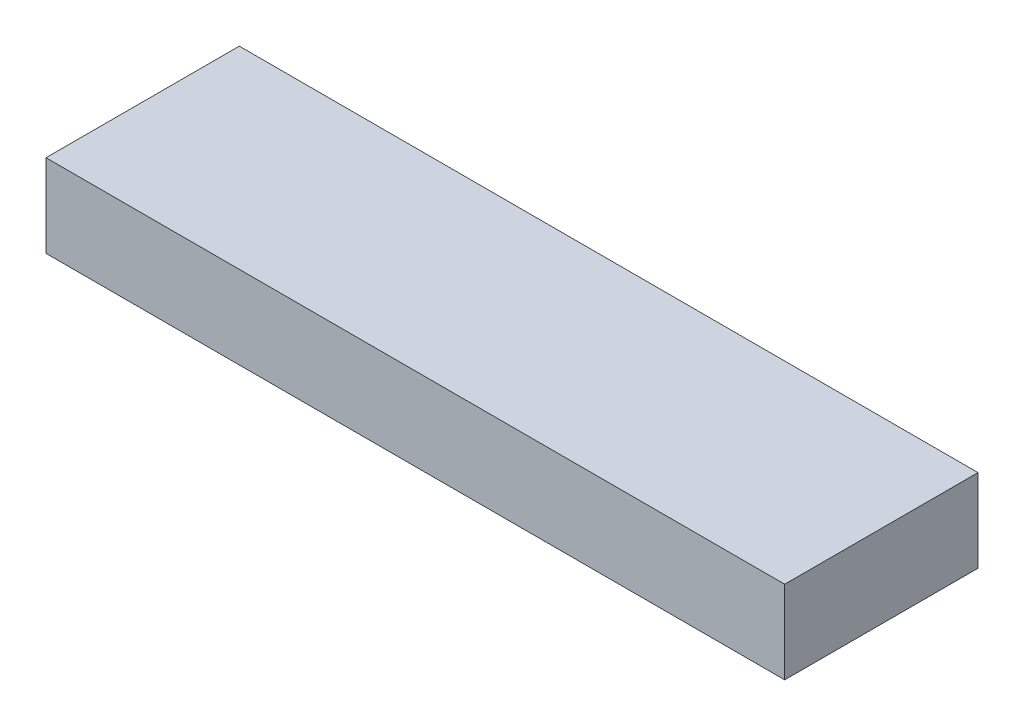
ISO-10303-21;
HEADER;
FILE_DESCRIPTION(('STEP AP214'),'2;1');
FILE_NAME('part.step','',(''),(''),'','','');
FILE_SCHEMA(('AUTOMOTIVE_DESIGN { 1 0 10303 214 1 1 1 1 }'));
ENDSEC;
DATA;
#1=APPLICATION_CONTEXT('core data for automotive mechanical design processes');
#2=APPLICATION_PROTOCOL_DEFINITION('international standard','automotive_design',2000,#1);
#3=PRODUCT_CONTEXT('',#1,'mechanical');
#4=PRODUCT('Part','Part','',(#3));
#5=PRODUCT_RELATED_PRODUCT_CATEGORY('part','',(#4));
#6=PRODUCT_DEFINITION_FORMATION('','',#4);
#7=PRODUCT_DEFINITION_CONTEXT('part definition',#1,'design');
#8=PRODUCT_DEFINITION('design','',#6,#7);
#9=PRODUCT_DEFINITION_SHAPE('','',#8);
#10=(LENGTH_UNIT() NAMED_UNIT(*) SI_UNIT(.MILLI.,.METRE.));
#11=(NAMED_UNIT(*) PLANE_ANGLE_UNIT() SI_UNIT($,.RADIAN.));
#12=(NAMED_UNIT(*) SI_UNIT($,.STERADIAN.) SOLID_ANGLE_UNIT());
#13=UNCERTAINTY_MEASURE_WITH_UNIT(LENGTH_MEASURE(1.E-05),#10,'distance_accuracy_value','');
#14=(GEOMETRIC_REPRESENTATION_CONTEXT(3) GLOBAL_UNCERTAINTY_ASSIGNED_CONTEXT((#13)) GLOBAL_UNIT_ASSIGNED_CONTEXT((#10,
#11,#12)) REPRESENTATION_CONTEXT('',''));
#15=CARTESIAN_POINT('',(0.,0.,0.));
#16=DIRECTION('',(0.,0.,1.));
#17=DIRECTION('',(1.,0.,0.));
#18=AXIS2_PLACEMENT_3D('',#15,#16,#17);
#19=CARTESIAN_POINT('',(0.,38.1,0.));
#20=DIRECTION('',(1.,0.,0.));
#21=DIRECTION('',(0.,0.,-1.));
#22=AXIS2_PLACEMENT_3D('',#19,#20,#21);
#23=PLANE('',#22);
#24=DIRECTION('',(0.,0.,1.));
#25=VECTOR('',#24,1.);
#26=CARTESIAN_POINT('',(0.,0.,0.));
#27=LINE('',#26,#25);
#28=CARTESIAN_POINT('',(0.,0.,-88.9));
#29=VERTEX_POINT('',#28);
#30=CARTESIAN_POINT('',(0.,0.,0.));
#31=VERTEX_POINT('',#30);
#32=EDGE_CURVE('E102',#29,#31,#27,.T.);
#33=ORIENTED_EDGE('',*,*,#32,.T.);
#34=DIRECTION('',(0.,-1.,0.));
#35=VECTOR('',#34,1.);
#36=CARTESIAN_POINT('',(0.,38.1,0.));
#37=LINE('',#36,#35);
#38=CARTESIAN_POINT('',(0.,38.1,0.));
#39=VERTEX_POINT('',#38);
#40=EDGE_CURVE('E11',#39,#31,#37,.T.);
#41=ORIENTED_EDGE('',*,*,#40,.F.);
#42=DIRECTION('',(0.,0.,1.));
#43=VECTOR('',#42,1.);
#44=CARTESIAN_POINT('',(0.,38.1,0.));
#45=LINE('',#44,#43);
#46=CARTESIAN_POINT('',(0.,38.1,-88.9));
#47=VERTEX_POINT('',#46);
#48=EDGE_CURVE('E90',#47,#39,#45,.T.);
#49=ORIENTED_EDGE('',*,*,#48,.F.);
#50=DIRECTION('',(0.,-1.,0.));
#51=VECTOR('',#50,1.);
#52=CARTESIAN_POINT('',(0.,38.1,-88.9));
#53=LINE('',#52,#51);
#54=EDGE_CURVE('E98',#47,#29,#53,.T.);
#55=ORIENTED_EDGE('',*,*,#54,.T.);
#56=EDGE_LOOP('',(#33,#41,#49,#55));
#57=FACE_BOUND('',#56,.T.);
#58=ADVANCED_FACE('F39',(#57),#23,.F.);
#59=CARTESIAN_POINT('',(0.,38.1,0.));
#60=DIRECTION('',(0.,0.,-1.));
#61=DIRECTION('',(-1.,0.,0.));
#62=AXIS2_PLACEMENT_3D('',#59,#60,#61);
#63=PLANE('',#62);
#64=DIRECTION('',(1.,0.,0.));
#65=VECTOR('',#64,1.);
#66=CARTESIAN_POINT('',(0.,0.,0.));
#67=LINE('',#66,#65);
#68=CARTESIAN_POINT('',(339.725,0.,0.));
#69=VERTEX_POINT('',#68);
#70=EDGE_CURVE('E94',#31,#69,#67,.T.);
#71=ORIENTED_EDGE('',*,*,#70,.T.);
#72=DIRECTION('',(0.,-1.,0.));
#73=VECTOR('',#72,1.);
#74=CARTESIAN_POINT('',(339.725,38.1,0.));
#75=LINE('',#74,#73);
#76=CARTESIAN_POINT('',(339.725,38.1,0.));
#77=VERTEX_POINT('',#76);
#78=EDGE_CURVE('E47',#77,#69,#75,.T.);
#79=ORIENTED_EDGE('',*,*,#78,.F.);
#80=DIRECTION('',(1.,0.,0.));
#81=VECTOR('',#80,1.);
#82=CARTESIAN_POINT('',(0.,38.1,0.));
#83=LINE('',#82,#81);
#84=EDGE_CURVE('E85',#39,#77,#83,.T.);
#85=ORIENTED_EDGE('',*,*,#84,.F.);
#86=ORIENTED_EDGE('',*,*,#40,.T.);
#87=EDGE_LOOP('',(#71,#79,#85,#86));
#88=FACE_BOUND('',#87,.T.);
#89=ADVANCED_FACE('F93',(#88),#63,.F.);
#90=CARTESIAN_POINT('',(339.725,38.1,0.));
#91=DIRECTION('',(-1.,0.,0.));
#92=DIRECTION('',(0.,0.,1.));
#93=AXIS2_PLACEMENT_3D('',#90,#91,#92);
#94=PLANE('',#93);
#95=DIRECTION('',(0.,0.,-1.));
#96=VECTOR('',#95,1.);
#97=CARTESIAN_POINT('',(339.725,0.,0.));
#98=LINE('',#97,#96);
#99=CARTESIAN_POINT('',(339.725,0.,-88.9));
#100=VERTEX_POINT('',#99);
#101=EDGE_CURVE('E72',#69,#100,#98,.T.);
#102=ORIENTED_EDGE('',*,*,#101,.T.);
#103=DIRECTION('',(0.,-1.,0.));
#104=VECTOR('',#103,1.);
#105=CARTESIAN_POINT('',(339.725,38.1,-88.9));
#106=LINE('',#105,#104);
#107=CARTESIAN_POINT('',(339.725,38.1,-88.9));
#108=VERTEX_POINT('',#107);
#109=EDGE_CURVE('E95',#108,#100,#106,.T.);
#110=ORIENTED_EDGE('',*,*,#109,.F.);
#111=DIRECTION('',(0.,0.,-1.));
#112=VECTOR('',#111,1.);
#113=CARTESIAN_POINT('',(339.725,38.1,0.));
#114=LINE('',#113,#112);
#115=EDGE_CURVE('E88',#77,#108,#114,.T.);
#116=ORIENTED_EDGE('',*,*,#115,.F.);
#117=ORIENTED_EDGE('',*,*,#78,.T.);
#118=EDGE_LOOP('',(#102,#110,#116,#117));
#119=FACE_BOUND('',#118,.T.);
#120=ADVANCED_FACE('F96',(#119),#94,.F.);
#121=CARTESIAN_POINT('',(0.,38.1,-88.9));
#122=DIRECTION('',(0.,0.,1.));
#123=DIRECTION('',(1.,0.,0.));
#124=AXIS2_PLACEMENT_3D('',#121,#122,#123);
#125=PLANE('',#124);
#126=DIRECTION('',(-1.,0.,0.));
#127=VECTOR('',#126,1.);
#128=CARTESIAN_POINT('',(0.,0.,-88.9));
#129=LINE('',#128,#127);
#130=EDGE_CURVE('E78',#100,#29,#129,.T.);
#131=ORIENTED_EDGE('',*,*,#130,.T.);
#132=ORIENTED_EDGE('',*,*,#54,.F.);
#133=DIRECTION('',(-1.,0.,0.));
#134=VECTOR('',#133,1.);
#135=CARTESIAN_POINT('',(0.,38.1,-88.9));
#136=LINE('',#135,#134);
#137=EDGE_CURVE('E55',#108,#47,#136,.T.);
#138=ORIENTED_EDGE('',*,*,#137,.F.);
#139=ORIENTED_EDGE('',*,*,#109,.T.);
#140=EDGE_LOOP('',(#131,#132,#138,#139));
#141=FACE_BOUND('',#140,.T.);
#142=ADVANCED_FACE('F109',(#141),#125,.F.);
#143=CARTESIAN_POINT('',(0.,38.1,0.));
#144=DIRECTION('',(0.,-1.,0.));
#145=DIRECTION('',(0.,0.,-1.));
#146=AXIS2_PLACEMENT_3D('',#143,#144,#145);
#147=PLANE('',#146);
#148=ORIENTED_EDGE('',*,*,#48,.T.);
#149=ORIENTED_EDGE('',*,*,#84,.T.);
#150=ORIENTED_EDGE('',*,*,#115,.T.);
#151=ORIENTED_EDGE('',*,*,#137,.T.);
#152=EDGE_LOOP('',(#148,#149,#150,#151));
#153=FACE_BOUND('',#152,.T.);
#154=ADVANCED_FACE('F86',(#153),#147,.F.);
#155=CARTESIAN_POINT('',(0.,0.,0.));
#156=DIRECTION('',(0.,-1.,0.));
#157=DIRECTION('',(0.,0.,-1.));
#158=AXIS2_PLACEMENT_3D('',#155,#156,#157);
#159=PLANE('',#158);
#160=ORIENTED_EDGE('',*,*,#32,.F.);
#161=ORIENTED_EDGE('',*,*,#130,.F.);
#162=ORIENTED_EDGE('',*,*,#101,.F.);
#163=ORIENTED_EDGE('',*,*,#70,.F.);
#164=EDGE_LOOP('',(#160,#161,#162,#163));
#165=FACE_BOUND('',#164,.T.);
#166=ADVANCED_FACE('F112',(#165),#159,.T.);
#167=CLOSED_SHELL('',(#58,#89,#120,#142,#154,#166));
#168=MANIFOLD_SOLID_BREP('B2',#167);
#169=ADVANCED_BREP_SHAPE_REPRESENTATION('',(#18,#168),#14);
#170=SHAPE_DEFINITION_REPRESENTATION(#9,#169);
ENDSEC;
END-ISO-10303-21;
